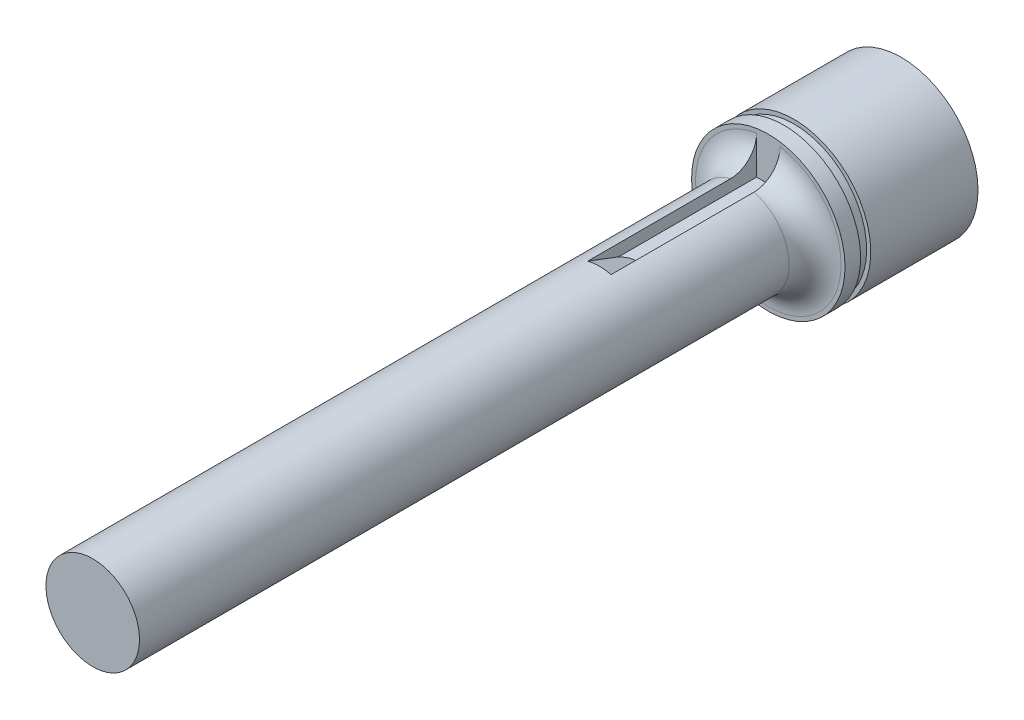
ISO-10303-21;
HEADER;
FILE_DESCRIPTION(('STEP AP214'),'2;1');
FILE_NAME('part.step','',(''),(''),'','','');
FILE_SCHEMA(('AUTOMOTIVE_DESIGN { 1 0 10303 214 1 1 1 1 }'));
ENDSEC;
DATA;
#1=APPLICATION_CONTEXT('core data for automotive mechanical design processes');
#2=APPLICATION_PROTOCOL_DEFINITION('international standard','automotive_design',2000,#1);
#3=PRODUCT_CONTEXT('',#1,'mechanical');
#4=PRODUCT('Part','Part','',(#3));
#5=PRODUCT_RELATED_PRODUCT_CATEGORY('part','',(#4));
#6=PRODUCT_DEFINITION_FORMATION('','',#4);
#7=PRODUCT_DEFINITION_CONTEXT('part definition',#1,'design');
#8=PRODUCT_DEFINITION('design','',#6,#7);
#9=PRODUCT_DEFINITION_SHAPE('','',#8);
#10=(LENGTH_UNIT() NAMED_UNIT(*) SI_UNIT(.MILLI.,.METRE.));
#11=(NAMED_UNIT(*) PLANE_ANGLE_UNIT() SI_UNIT($,.RADIAN.));
#12=(NAMED_UNIT(*) SI_UNIT($,.STERADIAN.) SOLID_ANGLE_UNIT());
#13=UNCERTAINTY_MEASURE_WITH_UNIT(LENGTH_MEASURE(1.E-05),#10,'distance_accuracy_value','');
#14=(GEOMETRIC_REPRESENTATION_CONTEXT(3) GLOBAL_UNCERTAINTY_ASSIGNED_CONTEXT((#13)) GLOBAL_UNIT_ASSIGNED_CONTEXT((#10,
#11,#12)) REPRESENTATION_CONTEXT('',''));
#15=CARTESIAN_POINT('',(0.,0.,0.));
#16=DIRECTION('',(0.,0.,1.));
#17=DIRECTION('',(1.,0.,0.));
#18=AXIS2_PLACEMENT_3D('',#15,#16,#17);
#19=CARTESIAN_POINT('',(0.,0.,66.04));
#20=DIRECTION('',(0.,0.,-1.));
#21=DIRECTION('',(-1.,0.,0.));
#22=AXIS2_PLACEMENT_3D('',#19,#20,#21);
#23=CYLINDRICAL_SURFACE('',#22,4.572);
#24=CARTESIAN_POINT('',(0.,0.,66.04));
#25=DIRECTION('',(0.,0.,1.));
#26=DIRECTION('',(1.,0.,0.));
#27=AXIS2_PLACEMENT_3D('',#24,#25,#26);
#28=CIRCLE('',#27,4.572);
#29=CARTESIAN_POINT('',(4.572,0.,66.04));
#30=VERTEX_POINT('',#29);
#31=EDGE_CURVE('E114',#30,#30,#28,.T.);
#32=ORIENTED_EDGE('',*,*,#31,.F.);
#33=EDGE_LOOP('',(#32));
#34=FACE_BOUND('',#33,.T.);
#35=DIRECTION('',(0.,0.,-1.));
#36=VECTOR('',#35,1.);
#37=CARTESIAN_POINT('',(1.143,4.42681996471508,66.04));
#38=LINE('',#37,#36);
#39=CARTESIAN_POINT('',(1.143,4.42681996471508,2.54));
#40=VERTEX_POINT('',#39);
#41=CARTESIAN_POINT('',(1.143,4.42681996471508,16.51));
#42=VERTEX_POINT('',#41);
#43=EDGE_CURVE('E112',#40,#42,#38,.F.);
#44=ORIENTED_EDGE('',*,*,#43,.T.);
#45=CARTESIAN_POINT('',(0.,0.,16.51));
#46=DIRECTION('',(0.,0.,1.));
#47=DIRECTION('',(1.,0.,0.));
#48=AXIS2_PLACEMENT_3D('',#45,#46,#47);
#49=CIRCLE('',#48,4.572);
#50=CARTESIAN_POINT('',(-1.143,4.42681996471508,16.51));
#51=VERTEX_POINT('',#50);
#52=EDGE_CURVE('E170',#42,#51,#49,.T.);
#53=ORIENTED_EDGE('',*,*,#52,.T.);
#54=DIRECTION('',(0.,0.,-1.));
#55=VECTOR('',#54,1.);
#56=CARTESIAN_POINT('',(-1.143,4.42681996471508,66.04));
#57=LINE('',#56,#55);
#58=CARTESIAN_POINT('',(-1.143,4.42681996471508,2.54));
#59=VERTEX_POINT('',#58);
#60=EDGE_CURVE('E110',#51,#59,#57,.T.);
#61=ORIENTED_EDGE('',*,*,#60,.T.);
#62=CARTESIAN_POINT('',(0.,0.,2.54));
#63=DIRECTION('',(0.,0.,1.));
#64=DIRECTION('',(0.,-1.,0.));
#65=AXIS2_PLACEMENT_3D('',#62,#63,#64);
#66=CIRCLE('',#65,4.572);
#67=EDGE_CURVE('E127',#59,#40,#66,.T.);
#68=ORIENTED_EDGE('',*,*,#67,.T.);
#69=EDGE_LOOP('',(#44,#53,#61,#68));
#70=FACE_BOUND('',#69,.T.);
#71=ADVANCED_FACE('F37',(#34,#70),#23,.T.);
#72=CARTESIAN_POINT('',(0.,0.,0.));
#73=DIRECTION('',(0.,0.,1.));
#74=DIRECTION('',(0.223003972649152,0.974817535840783,0.));
#75=AXIS2_PLACEMENT_3D('',#72,#73,#74);
#76=PLANE('',#75);
#77=CARTESIAN_POINT('',(0.,0.,0.));
#78=DIRECTION('',(0.,0.,1.));
#79=DIRECTION('',(0.223003972649152,0.974817535840783,0.));
#80=AXIS2_PLACEMENT_3D('',#77,#78,#79);
#81=CIRCLE('',#80,7.5);
#82=CARTESIAN_POINT('',(1.67252979486864,7.31113151880587,0.));
#83=VERTEX_POINT('',#82);
#84=EDGE_CURVE('E124',#83,#83,#81,.T.);
#85=ORIENTED_EDGE('',*,*,#84,.T.);
#86=EDGE_LOOP('',(#85));
#87=FACE_BOUND('',#86,.T.);
#88=DIRECTION('',(0.,1.,0.));
#89=VECTOR('',#88,1.);
#90=CARTESIAN_POINT('',(1.143,5.56981996471508,0.));
#91=LINE('',#90,#89);
#92=CARTESIAN_POINT('',(1.143,3.28381996471508,0.));
#93=VERTEX_POINT('',#92);
#94=CARTESIAN_POINT('',(1.143,7.01955091156122,0.));
#95=VERTEX_POINT('',#94);
#96=EDGE_CURVE('E93',#93,#95,#91,.T.);
#97=ORIENTED_EDGE('',*,*,#96,.T.);
#98=CARTESIAN_POINT('',(0.,0.,0.));
#99=DIRECTION('',(0.,0.,1.));
#100=DIRECTION('',(0.,-1.,0.));
#101=AXIS2_PLACEMENT_3D('',#98,#99,#100);
#102=CIRCLE('',#101,7.112);
#103=CARTESIAN_POINT('',(-1.143,7.01955091156122,0.));
#104=VERTEX_POINT('',#103);
#105=EDGE_CURVE('E138',#95,#104,#102,.F.);
#106=ORIENTED_EDGE('',*,*,#105,.T.);
#107=DIRECTION('',(0.,-1.,0.));
#108=VECTOR('',#107,1.);
#109=CARTESIAN_POINT('',(-1.143,5.56981996471508,0.));
#110=LINE('',#109,#108);
#111=CARTESIAN_POINT('',(-1.143,3.28381996471508,0.));
#112=VERTEX_POINT('',#111);
#113=EDGE_CURVE('E100',#104,#112,#110,.T.);
#114=ORIENTED_EDGE('',*,*,#113,.T.);
#115=DIRECTION('',(1.,0.,0.));
#116=VECTOR('',#115,1.);
#117=CARTESIAN_POINT('',(-1.143,3.28381996471508,0.));
#118=LINE('',#117,#116);
#119=EDGE_CURVE('E89',#112,#93,#118,.T.);
#120=ORIENTED_EDGE('',*,*,#119,.T.);
#121=EDGE_LOOP('',(#97,#106,#114,#120));
#122=FACE_BOUND('',#121,.T.);
#123=ADVANCED_FACE('F97',(#87,#122),#76,.T.);
#124=CARTESIAN_POINT('',(0.,0.,0.));
#125=DIRECTION('',(0.,0.,-1.));
#126=DIRECTION('',(-0.223003972649152,-0.974817535840783,0.));
#127=AXIS2_PLACEMENT_3D('',#124,#125,#126);
#128=CYLINDRICAL_SURFACE('',#127,7.5);
#129=CARTESIAN_POINT('',(0.,0.,-2.5146));
#130=DIRECTION('',(0.,0.,-1.));
#131=DIRECTION('',(-0.223003972649152,-0.974817535840783,0.));
#132=AXIS2_PLACEMENT_3D('',#129,#130,#131);
#133=CIRCLE('',#132,7.5);
#134=CARTESIAN_POINT('',(-1.67252979486864,-7.31113151880588,-2.5146));
#135=VERTEX_POINT('',#134);
#136=EDGE_CURVE('E131',#135,#135,#133,.T.);
#137=ORIENTED_EDGE('',*,*,#136,.T.);
#138=EDGE_LOOP('',(#137));
#139=FACE_BOUND('',#138,.T.);
#140=CARTESIAN_POINT('',(0.,0.,-13.));
#141=DIRECTION('',(0.,0.,1.));
#142=DIRECTION('',(0.223003972649152,0.974817535840783,0.));
#143=AXIS2_PLACEMENT_3D('',#140,#141,#142);
#144=CIRCLE('',#143,7.5);
#145=CARTESIAN_POINT('',(1.67252979486864,7.31113151880587,-13.));
#146=VERTEX_POINT('',#145);
#147=EDGE_CURVE('E128',#146,#146,#144,.T.);
#148=ORIENTED_EDGE('',*,*,#147,.T.);
#149=EDGE_LOOP('',(#148));
#150=FACE_BOUND('',#149,.T.);
#151=ADVANCED_FACE('F193',(#139,#150),#128,.T.);
#152=CARTESIAN_POINT('',(0.,0.,-13.));
#153=DIRECTION('',(0.,0.,1.));
#154=DIRECTION('',(0.223003972649152,0.974817535840783,0.));
#155=AXIS2_PLACEMENT_3D('',#152,#153,#154);
#156=PLANE('',#155);
#157=ORIENTED_EDGE('',*,*,#147,.F.);
#158=EDGE_LOOP('',(#157));
#159=FACE_BOUND('',#158,.T.);
#160=ADVANCED_FACE('F209',(#159),#156,.F.);
#161=CARTESIAN_POINT('',(0.,0.,-2.5146));
#162=DIRECTION('',(0.,0.,-1.));
#163=DIRECTION('',(-0.223003972649152,-0.974817535840783,0.));
#164=AXIS2_PLACEMENT_3D('',#161,#162,#163);
#165=PLANE('',#164);
#166=CARTESIAN_POINT('',(0.,0.,-2.5146));
#167=DIRECTION('',(0.,0.,1.));
#168=DIRECTION('',(0.223003972649152,0.974817535840783,0.));
#169=AXIS2_PLACEMENT_3D('',#166,#167,#168);
#170=CIRCLE('',#169,7.0993);
#171=CARTESIAN_POINT('',(1.58317210302812,6.92052213219447,-2.5146));
#172=VERTEX_POINT('',#171);
#173=EDGE_CURVE('E118',#172,#172,#170,.T.);
#174=ORIENTED_EDGE('',*,*,#173,.F.);
#175=EDGE_LOOP('',(#174));
#176=FACE_BOUND('',#175,.T.);
#177=ORIENTED_EDGE('',*,*,#136,.F.);
#178=EDGE_LOOP('',(#177));
#179=FACE_BOUND('',#178,.T.);
#180=ADVANCED_FACE('F206',(#176,#179),#165,.F.);
#181=CARTESIAN_POINT('',(0.,0.,-1.524));
#182=DIRECTION('',(0.,0.,-1.));
#183=DIRECTION('',(-0.223003972649152,-0.974817535840783,0.));
#184=AXIS2_PLACEMENT_3D('',#181,#182,#183);
#185=PLANE('',#184);
#186=CARTESIAN_POINT('',(0.,0.,-1.524));
#187=DIRECTION('',(0.,0.,1.));
#188=DIRECTION('',(0.223003972649152,0.974817535840783,0.));
#189=AXIS2_PLACEMENT_3D('',#186,#187,#188);
#190=CIRCLE('',#189,7.0993);
#191=CARTESIAN_POINT('',(1.58317210302812,6.92052213219447,-1.524));
#192=VERTEX_POINT('',#191);
#193=EDGE_CURVE('E117',#192,#192,#190,.T.);
#194=ORIENTED_EDGE('',*,*,#193,.T.);
#195=EDGE_LOOP('',(#194));
#196=FACE_BOUND('',#195,.T.);
#197=CARTESIAN_POINT('',(0.,0.,-1.524));
#198=DIRECTION('',(0.,0.,-1.));
#199=DIRECTION('',(-0.223003972649152,-0.974817535840783,0.));
#200=AXIS2_PLACEMENT_3D('',#197,#198,#199);
#201=CIRCLE('',#200,7.5);
#202=CARTESIAN_POINT('',(-1.67252979486864,-7.31113151880588,-1.524));
#203=VERTEX_POINT('',#202);
#204=EDGE_CURVE('E121',#203,#203,#201,.T.);
#205=ORIENTED_EDGE('',*,*,#204,.T.);
#206=EDGE_LOOP('',(#205));
#207=FACE_BOUND('',#206,.T.);
#208=ADVANCED_FACE('F204',(#196,#207),#185,.T.);
#209=CARTESIAN_POINT('',(0.,0.,-2.5146));
#210=DIRECTION('',(0.,0.,1.));
#211=DIRECTION('',(0.223003972649152,0.974817535840783,0.));
#212=AXIS2_PLACEMENT_3D('',#209,#210,#211);
#213=CYLINDRICAL_SURFACE('',#212,7.0993);
#214=ORIENTED_EDGE('',*,*,#173,.T.);
#215=EDGE_LOOP('',(#214));
#216=FACE_BOUND('',#215,.T.);
#217=ORIENTED_EDGE('',*,*,#193,.F.);
#218=EDGE_LOOP('',(#217));
#219=FACE_BOUND('',#218,.T.);
#220=ADVANCED_FACE('F200',(#216,#219),#213,.T.);
#221=ORIENTED_EDGE('',*,*,#84,.F.);
#222=EDGE_LOOP('',(#221));
#223=FACE_BOUND('',#222,.T.);
#224=ORIENTED_EDGE('',*,*,#204,.F.);
#225=EDGE_LOOP('',(#224));
#226=FACE_BOUND('',#225,.T.);
#227=ADVANCED_FACE('F203',(#223,#226),#128,.T.);
#228=CARTESIAN_POINT('',(0.,0.,66.04));
#229=DIRECTION('',(0.,0.,1.));
#230=DIRECTION('',(1.,0.,0.));
#231=AXIS2_PLACEMENT_3D('',#228,#229,#230);
#232=PLANE('',#231);
#233=ORIENTED_EDGE('',*,*,#31,.T.);
#234=EDGE_LOOP('',(#233));
#235=FACE_BOUND('',#234,.T.);
#236=ADVANCED_FACE('F199',(#235),#232,.T.);
#237=CARTESIAN_POINT('',(-1.143,5.56981996471508,12.7));
#238=DIRECTION('',(1.,0.,0.));
#239=DIRECTION('',(0.,0.,-1.));
#240=AXIS2_PLACEMENT_3D('',#237,#238,#239);
#241=PLANE('',#240);
#242=DIRECTION('',(0.,0.,-1.));
#243=VECTOR('',#242,1.);
#244=CARTESIAN_POINT('',(-1.143,3.28381996471508,12.7));
#245=LINE('',#244,#243);
#246=CARTESIAN_POINT('',(-1.143,3.28381996471508,13.5016677175337));
#247=VERTEX_POINT('',#246);
#248=EDGE_CURVE('E58',#247,#112,#245,.T.);
#249=ORIENTED_EDGE('',*,*,#248,.T.);
#250=ORIENTED_EDGE('',*,*,#113,.F.);
#251=CARTESIAN_POINT('',(-1.143,7.01955091156122,0.));
#252=CARTESIAN_POINT('',(-1.143,6.94585722491169,7.08199247502795E-07));
#253=CARTESIAN_POINT('',(-1.143,6.87219991471792,0.00312615603052806));
#254=CARTESIAN_POINT('',(-1.143,6.72541729249448,0.0155810537545392));
#255=CARTESIAN_POINT('',(-1.143,6.65229194014744,0.0249100284203478));
#256=CARTESIAN_POINT('',(-1.143,6.4346192627794,0.0620948451697209));
#257=CARTESIAN_POINT('',(-1.143,6.29153536149175,0.0991489051385516));
#258=CARTESIAN_POINT('',(-1.143,6.01362339549773,0.196699277205012));
#259=CARTESIAN_POINT('',(-1.143,5.87879819824521,0.257203678522499));
#260=CARTESIAN_POINT('',(-1.143,5.6211963391704,0.399968191165244));
#261=CARTESIAN_POINT('',(-1.143,5.4984183477018,0.482225897873684));
#262=CARTESIAN_POINT('',(-1.143,5.26844076581022,0.666306842618027));
#263=CARTESIAN_POINT('',(-1.143,5.16124746935049,0.768137947138222));
#264=CARTESIAN_POINT('',(-1.143,4.9657527987858,0.988616941209656));
#265=CARTESIAN_POINT('',(-1.143,4.87745436515187,1.10726744347288));
#266=CARTESIAN_POINT('',(-1.143,4.72381863680006,1.3562177498072));
#267=CARTESIAN_POINT('',(-1.143,4.65816628772803,1.48632318762186));
#268=CARTESIAN_POINT('',(-1.143,4.55041195214979,1.75588320312741));
#269=CARTESIAN_POINT('',(-1.143,4.50828541229089,1.89532786275857));
#270=CARTESIAN_POINT('',(-1.143,4.46146325158605,2.11994862091254));
#271=CARTESIAN_POINT('',(-1.143,4.44848330790946,2.20348035525511));
#272=CARTESIAN_POINT('',(-1.143,4.43116256913207,2.37132703509241));
#273=CARTESIAN_POINT('',(-1.143,4.42681083545645,2.45564085259249));
#274=CARTESIAN_POINT('',(-1.143,4.42681996471506,2.54));
#275=B_SPLINE_CURVE_WITH_KNOTS('',3,(#251,#252,#253,#254,#255,#256,#257,#258,#259,#260,#261,
#262,#263,#264,#265,#266,#267,#268,#269,#270,#271,#272,#273,#274),.UNSPECIFIED.,.F.,.F.,(4,2,2,
2,2,2,2,2,2,2,2,4),(0.,0.220943209625667,0.441869495641559,0.883011381415675,1.32430557517598,
1.76555100852085,2.20697414915028,2.64846593539662,3.08354131660472,3.51816176682811,
3.77136025435844,4.02423753899058),.UNSPECIFIED.);
#276=EDGE_CURVE('E146',#104,#59,#275,.T.);
#277=ORIENTED_EDGE('',*,*,#276,.T.);
#278=ORIENTED_EDGE('',*,*,#60,.F.);
#279=CARTESIAN_POINT('',(-1.143,4.42681996471508,16.51));
#280=CARTESIAN_POINT('',(-1.143,4.3324525841518,16.2589710054198));
#281=CARTESIAN_POINT('',(-1.143,4.23792666272938,16.0080014728959));
#282=CARTESIAN_POINT('',(-1.143,4.04847113008751,15.5062160350793));
#283=CARTESIAN_POINT('',(-1.143,3.95354152053452,15.2554001291572));
#284=CARTESIAN_POINT('',(-1.143,3.76319107762949,14.7539541840618));
#285=CARTESIAN_POINT('',(-1.143,3.66777024350864,14.5033241451801));
#286=CARTESIAN_POINT('',(-1.143,3.47630035803226,14.0023030212478));
#287=CARTESIAN_POINT('',(-1.143,3.38025130407242,13.7519119371928));
#288=CARTESIAN_POINT('',(-1.143,3.28381996471511,13.5016677175336));
#289=B_SPLINE_CURVE_WITH_KNOTS('',3,(#279,#280,#281,#282,#283,#284,#285,#286,#287,#288),
.UNSPECIFIED.,.F.,.F.,(4,2,2,2,4),(0.,0.804541502054059,1.6090796861253,2.41361912976028,
3.21816191077781),.UNSPECIFIED.);
#290=EDGE_CURVE('E11',#51,#247,#289,.T.);
#291=ORIENTED_EDGE('',*,*,#290,.T.);
#292=EDGE_LOOP('',(#249,#250,#277,#278,#291));
#293=FACE_BOUND('',#292,.T.);
#294=ADVANCED_FACE('F158',(#293),#241,.T.);
#295=CARTESIAN_POINT('',(1.143,5.56981996471508,12.7));
#296=DIRECTION('',(-1.,0.,0.));
#297=DIRECTION('',(0.,-1.,0.));
#298=AXIS2_PLACEMENT_3D('',#295,#296,#297);
#299=PLANE('',#298);
#300=DIRECTION('',(0.,0.,-1.));
#301=VECTOR('',#300,1.);
#302=CARTESIAN_POINT('',(1.143,3.28381996471508,12.7));
#303=LINE('',#302,#301);
#304=CARTESIAN_POINT('',(1.143,3.28381996471508,13.5016677175337));
#305=VERTEX_POINT('',#304);
#306=EDGE_CURVE('E65',#305,#93,#303,.T.);
#307=ORIENTED_EDGE('',*,*,#306,.F.);
#308=CARTESIAN_POINT('',(1.143,3.28381996471508,13.5016677175337));
#309=CARTESIAN_POINT('',(1.143,3.3802513040724,13.7519119371928));
#310=CARTESIAN_POINT('',(1.143,3.47630035803226,14.0023030212478));
#311=CARTESIAN_POINT('',(1.143,3.66777024350864,14.5033241451801));
#312=CARTESIAN_POINT('',(1.143,3.76319107762949,14.7539541840618));
#313=CARTESIAN_POINT('',(1.143,3.95354152053452,15.2554001291572));
#314=CARTESIAN_POINT('',(1.143,4.04847113008751,15.5062160350793));
#315=CARTESIAN_POINT('',(1.143,4.23792666272938,16.0080014728959));
#316=CARTESIAN_POINT('',(1.143,4.33245258415181,16.2589710054198));
#317=CARTESIAN_POINT('',(1.143,4.42681996471509,16.51));
#318=B_SPLINE_CURVE_WITH_KNOTS('',3,(#308,#309,#310,#311,#312,#313,#314,#315,#316,#317),
.UNSPECIFIED.,.F.,.F.,(4,2,2,2,4),(0.,0.804542781017522,1.6090822246525,2.41362040872375,
3.21816191077781),.UNSPECIFIED.);
#319=EDGE_CURVE('E51',#305,#42,#318,.T.);
#320=ORIENTED_EDGE('',*,*,#319,.T.);
#321=ORIENTED_EDGE('',*,*,#43,.F.);
#322=CARTESIAN_POINT('',(1.143,4.42681996471508,2.54));
#323=CARTESIAN_POINT('',(1.143,4.42681084813168,2.46995703243776));
#324=CARTESIAN_POINT('',(1.143,4.42981210517563,2.39991849458614));
#325=CARTESIAN_POINT('',(1.143,4.44176512990372,2.26036073145835));
#326=CARTESIAN_POINT('',(1.143,4.45071604874698,2.19084143353253));
#327=CARTESIAN_POINT('',(1.143,4.474476342737,2.0529391791709));
#328=CARTESIAN_POINT('',(1.143,4.48927492028266,1.98455436906434));
#329=CARTESIAN_POINT('',(1.143,4.52458137251997,1.84929412401768));
#330=CARTESIAN_POINT('',(1.143,4.54508929116336,1.78241870070144));
#331=CARTESIAN_POINT('',(1.143,4.61493522039413,1.58475530908944));
#332=CARTESIAN_POINT('',(1.143,4.67261674321382,1.45680776630344));
#333=CARTESIAN_POINT('',(1.143,4.8082495195776,1.21223526105136));
#334=CARTESIAN_POINT('',(1.143,4.88620454700151,1.09561241221553));
#335=CARTESIAN_POINT('',(1.143,5.06154583741372,0.874663194611878));
#336=CARTESIAN_POINT('',(1.143,5.15924685767333,0.770586343259584));
#337=CARTESIAN_POINT('',(1.143,5.3703575100805,0.579792321379612));
#338=CARTESIAN_POINT('',(1.143,5.48377098392415,0.493079409054389));
#339=CARTESIAN_POINT('',(1.143,5.72625403920249,0.33723135449759));
#340=CARTESIAN_POINT('',(1.143,5.85565178087313,0.268606820486739));
#341=CARTESIAN_POINT('',(1.143,6.12402511576333,0.153823291815453));
#342=CARTESIAN_POINT('',(1.143,6.26299639896908,0.107654262162133));
#343=CARTESIAN_POINT('',(1.143,6.50537974279569,0.0490217447058653));
#344=CARTESIAN_POINT('',(1.143,6.60740626731499,0.0306648959821712));
#345=CARTESIAN_POINT('',(1.143,6.81279089199669,0.00615213595742391));
#346=CARTESIAN_POINT('',(1.143,6.91614727312293,-1.81910691806765E-05));
#347=CARTESIAN_POINT('',(1.143,7.01955091156122,0.));
#348=B_SPLINE_CURVE_WITH_KNOTS('',3,(#322,#323,#324,#325,#326,#327,#328,#329,#330,#331,#332,
#333,#334,#335,#336,#337,#338,#339,#340,#341,#342,#343,#344,#345,#346,#347),.UNSPECIFIED.,.F.,
.F.,(4,2,2,2,2,2,2,2,2,2,2,2,4),(0.,0.210056933635979,0.420083904786416,0.629724863474453,
0.839367436068013,1.25828437967688,1.6772793598775,2.10357125491751,2.52996756290911,
2.96735294807439,3.40454269295622,3.71484823219829,4.02478648328085),.UNSPECIFIED.);
#349=EDGE_CURVE('E104',#40,#95,#348,.T.);
#350=ORIENTED_EDGE('',*,*,#349,.T.);
#351=ORIENTED_EDGE('',*,*,#96,.F.);
#352=EDGE_LOOP('',(#307,#320,#321,#350,#351));
#353=FACE_BOUND('',#352,.T.);
#354=ADVANCED_FACE('F102',(#353),#299,.T.);
#355=CARTESIAN_POINT('',(-1.143,3.28381996471508,12.7));
#356=DIRECTION('',(0.,1.,0.));
#357=DIRECTION('',(-1.,0.,0.));
#358=AXIS2_PLACEMENT_3D('',#355,#356,#357);
#359=PLANE('',#358);
#360=ORIENTED_EDGE('',*,*,#306,.T.);
#361=ORIENTED_EDGE('',*,*,#119,.F.);
#362=ORIENTED_EDGE('',*,*,#248,.F.);
#363=CARTESIAN_POINT('',(-1.143,3.28381996471508,13.5016677175337));
#364=CARTESIAN_POINT('',(-1.10342805986197,3.28381996471508,13.465947798879));
#365=CARTESIAN_POINT('',(-1.0630620291174,3.28381996471508,13.4311254014079));
#366=CARTESIAN_POINT('',(-0.980397320725644,3.28381996471508,13.3636372721809));
#367=CARTESIAN_POINT('',(-0.938093918078875,3.28381996471508,13.3309773465278));
#368=CARTESIAN_POINT('',(-0.806722531353759,3.28381996471508,13.2360848099627));
#369=CARTESIAN_POINT('',(-0.714411827041825,3.28381996471508,13.178083371208));
#370=CARTESIAN_POINT('',(-0.550648895180106,3.28381996471508,13.0949433955219));
#371=CARTESIAN_POINT('',(-0.4815686522289,3.28381996471508,13.065188532576));
#372=CARTESIAN_POINT('',(-0.339886297454759,3.28381996471508,13.0169164910968));
#373=CARTESIAN_POINT('',(-0.267306334833751,3.28381996471508,12.9983366544135));
#374=CARTESIAN_POINT('',(-0.124992731661379,3.28381996471508,12.9753286369379));
#375=CARTESIAN_POINT('',(-0.055405553155594,3.28381996471508,12.9700168253698));
#376=CARTESIAN_POINT('',(0.0836362628193132,3.28381996471508,12.9716587566552));
#377=CARTESIAN_POINT('',(0.153090870895718,3.28381996471508,12.9786149605576));
#378=CARTESIAN_POINT('',(0.28934819902711,3.28381996471508,13.0037926482898));
#379=CARTESIAN_POINT('',(0.356166215191186,3.28381996471508,13.021934009913));
#380=CARTESIAN_POINT('',(0.486750412181497,3.28381996471508,13.0675832992641));
#381=CARTESIAN_POINT('',(0.550501862924718,3.28381996471508,13.09513210994));
#382=CARTESIAN_POINT('',(0.710166341319327,3.28381996471508,13.1755378747222));
#383=CARTESIAN_POINT('',(0.80333055238494,3.28381996471508,13.2338130268652));
#384=CARTESIAN_POINT('',(0.935955953635261,3.28381996471508,13.3293490578375));
#385=CARTESIAN_POINT('',(0.978717763325788,3.28381996471508,13.3623041843393));
#386=CARTESIAN_POINT('',(1.06225230150929,3.28381996471508,13.4304277261987));
#387=CARTESIAN_POINT('',(1.10303014564146,3.28381996471508,13.4655898480128));
#388=CARTESIAN_POINT('',(1.143,3.28381996471508,13.5016677175337));
#389=B_SPLINE_CURVE_WITH_KNOTS('',3,(#363,#364,#365,#366,#367,#368,#369,#370,#371,#372,#373,
#374,#375,#376,#377,#378,#379,#380,#381,#382,#383,#384,#385,#386,#387,#388),.UNSPECIFIED.,.F.,
.F.,(4,2,2,2,2,2,2,2,2,2,2,2,4),(0.,0.159875345560519,0.320163861523085,0.645728436963232,
0.870663558627488,1.09432542222403,1.30263900903973,1.5109943897572,1.71787433320743,
1.92566502643568,2.25375789977441,2.4156765387333,2.57715275730749),.UNSPECIFIED.);
#390=EDGE_CURVE('E91',#247,#305,#389,.T.);
#391=ORIENTED_EDGE('',*,*,#390,.T.);
#392=EDGE_LOOP('',(#360,#361,#362,#391));
#393=FACE_BOUND('',#392,.T.);
#394=ADVANCED_FACE('F88',(#393),#359,.T.);
#395=CARTESIAN_POINT('',(0.,0.,2.54));
#396=DIRECTION('',(0.,0.,1.));
#397=DIRECTION('',(0.,-1.,0.));
#398=AXIS2_PLACEMENT_3D('',#395,#396,#397);
#399=TOROIDAL_SURFACE('',#398,7.112,2.54);
#400=ORIENTED_EDGE('',*,*,#276,.F.);
#401=ORIENTED_EDGE('',*,*,#105,.F.);
#402=ORIENTED_EDGE('',*,*,#349,.F.);
#403=ORIENTED_EDGE('',*,*,#67,.F.);
#404=EDGE_LOOP('',(#400,#401,#402,#403));
#405=FACE_BOUND('',#404,.T.);
#406=ADVANCED_FACE('F152',(#405),#399,.F.);
#407=CARTESIAN_POINT('',(0.,0.,12.7));
#408=DIRECTION('',(0.,0.,1.));
#409=DIRECTION('',(1.,0.,0.));
#410=AXIS2_PLACEMENT_3D('',#407,#408,#409);
#411=CONICAL_SURFACE('',#410,3.18527340744573,0.349065850398874);
#412=ORIENTED_EDGE('',*,*,#290,.F.);
#413=ORIENTED_EDGE('',*,*,#52,.F.);
#414=ORIENTED_EDGE('',*,*,#319,.F.);
#415=ORIENTED_EDGE('',*,*,#390,.F.);
#416=EDGE_LOOP('',(#412,#413,#414,#415));
#417=FACE_BOUND('',#416,.T.);
#418=ADVANCED_FACE('F39',(#417),#411,.T.);
#419=CLOSED_SHELL('',(#71,#123,#151,#160,#180,#208,#220,#227,#236,#294,#354,#394,#406,#418));
#420=MANIFOLD_SOLID_BREP('B2',#419);
#421=ADVANCED_BREP_SHAPE_REPRESENTATION('',(#18,#420),#14);
#422=SHAPE_DEFINITION_REPRESENTATION(#9,#421);
ENDSEC;
END-ISO-10303-21;
